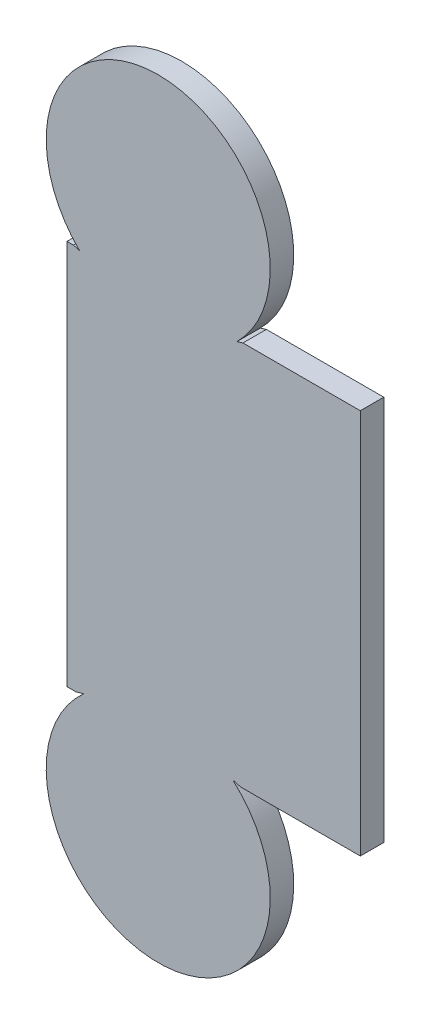
ISO-10303-21;
HEADER;
FILE_DESCRIPTION(('STEP AP214'),'2;1');
FILE_NAME('part.step','',(''),(''),'','','');
FILE_SCHEMA(('AUTOMOTIVE_DESIGN { 1 0 10303 214 1 1 1 1 }'));
ENDSEC;
DATA;
#1=APPLICATION_CONTEXT('core data for automotive mechanical design processes');
#2=APPLICATION_PROTOCOL_DEFINITION('international standard','automotive_design',2000,#1);
#3=PRODUCT_CONTEXT('',#1,'mechanical');
#4=PRODUCT('Part','Part','',(#3));
#5=PRODUCT_RELATED_PRODUCT_CATEGORY('part','',(#4));
#6=PRODUCT_DEFINITION_FORMATION('','',#4);
#7=PRODUCT_DEFINITION_CONTEXT('part definition',#1,'design');
#8=PRODUCT_DEFINITION('design','',#6,#7);
#9=PRODUCT_DEFINITION_SHAPE('','',#8);
#10=(LENGTH_UNIT() NAMED_UNIT(*) SI_UNIT(.MILLI.,.METRE.));
#11=(NAMED_UNIT(*) PLANE_ANGLE_UNIT() SI_UNIT($,.RADIAN.));
#12=(NAMED_UNIT(*) SI_UNIT($,.STERADIAN.) SOLID_ANGLE_UNIT());
#13=UNCERTAINTY_MEASURE_WITH_UNIT(LENGTH_MEASURE(1.E-05),#10,'distance_accuracy_value','');
#14=(GEOMETRIC_REPRESENTATION_CONTEXT(3) GLOBAL_UNCERTAINTY_ASSIGNED_CONTEXT((#13)) GLOBAL_UNIT_ASSIGNED_CONTEXT((#10,
#11,#12)) REPRESENTATION_CONTEXT('',''));
#15=CARTESIAN_POINT('',(0.,0.,0.));
#16=DIRECTION('',(0.,0.,1.));
#17=DIRECTION('',(1.,0.,0.));
#18=AXIS2_PLACEMENT_3D('',#15,#16,#17);
#19=CARTESIAN_POINT('',(231.439551417382,-103.246793579175,283.941063903925));
#20=DIRECTION('',(0.,0.,-1.));
#21=DIRECTION('',(0.,1.,0.));
#22=AXIS2_PLACEMENT_3D('',#19,#20,#21);
#23=CYLINDRICAL_SURFACE('',#22,2.42529676786338);
#24=CARTESIAN_POINT('',(231.439551417382,-103.246793579175,283.432971220494));
#25=DIRECTION('',(0.,0.,-1.));
#26=DIRECTION('',(0.665903119549627,0.746038226483117,0.));
#27=AXIS2_PLACEMENT_3D('',#24,#25,#26);
#28=CIRCLE('',#27,2.42529676786338);
#29=CARTESIAN_POINT('',(233.054564100935,-101.437429479783,283.432971220494));
#30=VERTEX_POINT('',#29);
#31=CARTESIAN_POINT('',(229.824538733828,-101.437429479783,283.432971220494));
#32=VERTEX_POINT('',#31);
#33=EDGE_CURVE('E136',#30,#32,#28,.T.);
#34=ORIENTED_EDGE('',*,*,#33,.F.);
#35=DIRECTION('',(0.,0.,-1.));
#36=VECTOR('',#35,1.);
#37=CARTESIAN_POINT('',(233.054564100935,-101.437429479783,283.941063903925));
#38=LINE('',#37,#36);
#39=CARTESIAN_POINT('',(233.054564100935,-101.437429479783,283.941063903925));
#40=VERTEX_POINT('',#39);
#41=EDGE_CURVE('E32',#40,#30,#38,.T.);
#42=ORIENTED_EDGE('',*,*,#41,.F.);
#43=CARTESIAN_POINT('',(231.439551417382,-103.246793579175,283.941063903925));
#44=DIRECTION('',(0.,0.,-1.));
#45=DIRECTION('',(0.665903119549627,0.746038226483117,0.));
#46=AXIS2_PLACEMENT_3D('',#43,#44,#45);
#47=CIRCLE('',#46,2.42529676786338);
#48=CARTESIAN_POINT('',(229.824538733828,-101.437429479783,283.941063903925));
#49=VERTEX_POINT('',#48);
#50=EDGE_CURVE('E168',#40,#49,#47,.T.);
#51=ORIENTED_EDGE('',*,*,#50,.T.);
#52=DIRECTION('',(0.,0.,-1.));
#53=VECTOR('',#52,1.);
#54=CARTESIAN_POINT('',(229.824538733828,-101.437429479783,283.941063903925));
#55=LINE('',#54,#53);
#56=EDGE_CURVE('E10',#49,#32,#55,.T.);
#57=ORIENTED_EDGE('',*,*,#56,.T.);
#58=EDGE_LOOP('',(#34,#42,#51,#57));
#59=FACE_BOUND('',#58,.T.);
#60=ADVANCED_FACE('F16',(#59),#23,.T.);
#61=CARTESIAN_POINT('',(229.654350957474,-101.483863074311,283.941063903925));
#62=DIRECTION('',(0.2632163146213,-0.964736840655098,0.));
#63=DIRECTION('',(0.964736840655099,0.2632163146213,0.));
#64=AXIS2_PLACEMENT_3D('',#61,#62,#63);
#65=PLANE('',#64);
#66=DIRECTION('',(-0.964736840655099,-0.2632163146213,0.));
#67=VECTOR('',#66,1.);
#68=CARTESIAN_POINT('',(229.654350957474,-101.483863074311,283.432971220494));
#69=LINE('',#68,#67);
#70=CARTESIAN_POINT('',(229.654350957474,-101.483863074311,283.432971220494));
#71=VERTEX_POINT('',#70);
#72=EDGE_CURVE('E139',#32,#71,#69,.T.);
#73=ORIENTED_EDGE('',*,*,#72,.F.);
#74=ORIENTED_EDGE('',*,*,#56,.F.);
#75=DIRECTION('',(-0.964736840655099,-0.2632163146213,0.));
#76=VECTOR('',#75,1.);
#77=CARTESIAN_POINT('',(229.654350957474,-101.483863074311,283.941063903925));
#78=LINE('',#77,#76);
#79=CARTESIAN_POINT('',(229.654350957474,-101.483863074311,283.941063903925));
#80=VERTEX_POINT('',#79);
#81=EDGE_CURVE('E185',#49,#80,#78,.T.);
#82=ORIENTED_EDGE('',*,*,#81,.T.);
#83=DIRECTION('',(0.,0.,-1.));
#84=VECTOR('',#83,1.);
#85=CARTESIAN_POINT('',(229.654350957474,-101.483863074311,283.941063903925));
#86=LINE('',#85,#84);
#87=EDGE_CURVE('E24',#80,#71,#86,.T.);
#88=ORIENTED_EDGE('',*,*,#87,.T.);
#89=EDGE_LOOP('',(#73,#74,#82,#88));
#90=FACE_BOUND('',#89,.T.);
#91=ADVANCED_FACE('F184',(#90),#65,.T.);
#92=CARTESIAN_POINT('',(229.654350957474,-101.483863074311,283.941063903925));
#93=DIRECTION('',(0.,-1.,0.));
#94=DIRECTION('',(0.,0.,-1.));
#95=AXIS2_PLACEMENT_3D('',#92,#93,#94);
#96=PLANE('',#95);
#97=DIRECTION('',(-1.,0.,0.));
#98=VECTOR('',#97,1.);
#99=CARTESIAN_POINT('',(229.654350957474,-101.483863074311,283.432971220494));
#100=LINE('',#99,#98);
#101=CARTESIAN_POINT('',(229.464481922245,-101.483863074311,283.432971220494));
#102=VERTEX_POINT('',#101);
#103=EDGE_CURVE('E142',#71,#102,#100,.T.);
#104=ORIENTED_EDGE('',*,*,#103,.F.);
#105=ORIENTED_EDGE('',*,*,#87,.F.);
#106=DIRECTION('',(-1.,0.,0.));
#107=VECTOR('',#106,1.);
#108=CARTESIAN_POINT('',(229.654350957474,-101.483863074311,283.941063903925));
#109=LINE('',#108,#107);
#110=CARTESIAN_POINT('',(229.464481922245,-101.483863074311,283.941063903925));
#111=VERTEX_POINT('',#110);
#112=EDGE_CURVE('E194',#80,#111,#109,.T.);
#113=ORIENTED_EDGE('',*,*,#112,.T.);
#114=DIRECTION('',(0.,0.,-1.));
#115=VECTOR('',#114,1.);
#116=CARTESIAN_POINT('',(229.464481922245,-101.483863074311,283.941063903925));
#117=LINE('',#116,#115);
#118=EDGE_CURVE('E182',#111,#102,#117,.T.);
#119=ORIENTED_EDGE('',*,*,#118,.T.);
#120=EDGE_LOOP('',(#104,#105,#113,#119));
#121=FACE_BOUND('',#120,.T.);
#122=ADVANCED_FACE('F189',(#121),#96,.T.);
#123=CARTESIAN_POINT('',(229.464481922245,-101.483863074311,283.941063903925));
#124=DIRECTION('',(-1.,0.,0.));
#125=DIRECTION('',(0.,0.,1.));
#126=AXIS2_PLACEMENT_3D('',#123,#124,#125);
#127=PLANE('',#126);
#128=DIRECTION('',(0.,1.,0.));
#129=VECTOR('',#128,1.);
#130=CARTESIAN_POINT('',(229.464481922245,-101.483863074311,283.432971220494));
#131=LINE('',#130,#129);
#132=CARTESIAN_POINT('',(229.464481922245,-93.1337240840387,283.432971220494));
#133=VERTEX_POINT('',#132);
#134=EDGE_CURVE('E145',#102,#133,#131,.T.);
#135=ORIENTED_EDGE('',*,*,#134,.F.);
#136=ORIENTED_EDGE('',*,*,#118,.F.);
#137=DIRECTION('',(0.,1.,0.));
#138=VECTOR('',#137,1.);
#139=CARTESIAN_POINT('',(229.464481922245,-101.483863074311,283.941063903925));
#140=LINE('',#139,#138);
#141=CARTESIAN_POINT('',(229.464481922245,-93.1337240840387,283.941063903925));
#142=VERTEX_POINT('',#141);
#143=EDGE_CURVE('E198',#111,#142,#140,.T.);
#144=ORIENTED_EDGE('',*,*,#143,.T.);
#145=DIRECTION('',(0.,0.,-1.));
#146=VECTOR('',#145,1.);
#147=CARTESIAN_POINT('',(229.464481922245,-93.1337240840387,283.941063903925));
#148=LINE('',#147,#146);
#149=EDGE_CURVE('E180',#142,#133,#148,.T.);
#150=ORIENTED_EDGE('',*,*,#149,.T.);
#151=EDGE_LOOP('',(#135,#136,#144,#150));
#152=FACE_BOUND('',#151,.T.);
#153=ADVANCED_FACE('F233',(#152),#127,.T.);
#154=CARTESIAN_POINT('',(229.464481922245,-93.1337240840387,283.941063903925));
#155=DIRECTION('',(0.,1.,0.));
#156=DIRECTION('',(0.,0.,1.));
#157=AXIS2_PLACEMENT_3D('',#154,#155,#156);
#158=PLANE('',#157);
#159=DIRECTION('',(1.,0.,0.));
#160=VECTOR('',#159,1.);
#161=CARTESIAN_POINT('',(229.464481922245,-93.1337240840387,283.432971220494));
#162=LINE('',#161,#160);
#163=CARTESIAN_POINT('',(229.605920498005,-93.1337240840387,283.432971220494));
#164=VERTEX_POINT('',#163);
#165=EDGE_CURVE('E148',#133,#164,#162,.T.);
#166=ORIENTED_EDGE('',*,*,#165,.F.);
#167=ORIENTED_EDGE('',*,*,#149,.F.);
#168=DIRECTION('',(1.,0.,0.));
#169=VECTOR('',#168,1.);
#170=CARTESIAN_POINT('',(229.464481922245,-93.1337240840387,283.941063903925));
#171=LINE('',#170,#169);
#172=CARTESIAN_POINT('',(229.605920498005,-93.1337240840387,283.941063903925));
#173=VERTEX_POINT('',#172);
#174=EDGE_CURVE('E201',#142,#173,#171,.T.);
#175=ORIENTED_EDGE('',*,*,#174,.T.);
#176=DIRECTION('',(0.,0.,-1.));
#177=VECTOR('',#176,1.);
#178=CARTESIAN_POINT('',(229.605920498005,-93.1337240840387,283.941063903925));
#179=LINE('',#178,#177);
#180=EDGE_CURVE('E178',#173,#164,#179,.T.);
#181=ORIENTED_EDGE('',*,*,#180,.T.);
#182=EDGE_LOOP('',(#166,#167,#175,#181));
#183=FACE_BOUND('',#182,.T.);
#184=ADVANCED_FACE('F231',(#183),#158,.T.);
#185=CARTESIAN_POINT('',(230.176772899703,-93.3090208519021,283.941063903925));
#186=DIRECTION('',(0.29355019531881,0.955943660907006,0.));
#187=DIRECTION('',(-0.955943660907006,0.29355019531881,0.));
#188=AXIS2_PLACEMENT_3D('',#185,#186,#187);
#189=PLANE('',#188);
#190=DIRECTION('',(0.955943660907006,-0.29355019531881,0.));
#191=VECTOR('',#190,1.);
#192=CARTESIAN_POINT('',(230.176772899703,-93.3090208519021,283.432971220494));
#193=LINE('',#192,#191);
#194=CARTESIAN_POINT('',(229.736904236446,-93.1739464356012,283.432971220494));
#195=VERTEX_POINT('',#194);
#196=EDGE_CURVE('E151',#164,#195,#193,.T.);
#197=ORIENTED_EDGE('',*,*,#196,.F.);
#198=ORIENTED_EDGE('',*,*,#180,.F.);
#199=DIRECTION('',(0.955943660907006,-0.29355019531881,0.));
#200=VECTOR('',#199,1.);
#201=CARTESIAN_POINT('',(230.176772899703,-93.3090208519021,283.941063903925));
#202=LINE('',#201,#200);
#203=CARTESIAN_POINT('',(229.736904236446,-93.1739464356012,283.941063903925));
#204=VERTEX_POINT('',#203);
#205=EDGE_CURVE('E204',#173,#204,#202,.T.);
#206=ORIENTED_EDGE('',*,*,#205,.T.);
#207=DIRECTION('',(0.,0.,-1.));
#208=VECTOR('',#207,1.);
#209=CARTESIAN_POINT('',(229.736904236446,-93.1739464356012,283.941063903925));
#210=LINE('',#209,#208);
#211=EDGE_CURVE('E176',#204,#195,#210,.T.);
#212=ORIENTED_EDGE('',*,*,#211,.T.);
#213=EDGE_LOOP('',(#197,#198,#206,#212));
#214=FACE_BOUND('',#213,.T.);
#215=ADVANCED_FACE('F226',(#214),#189,.T.);
#216=CARTESIAN_POINT('',(231.439551417381,-91.4467935791749,283.941063903925));
#217=DIRECTION('',(0.,0.,-1.));
#218=DIRECTION('',(0.,1.,0.));
#219=AXIS2_PLACEMENT_3D('',#216,#217,#218);
#220=CYLINDRICAL_SURFACE('',#219,2.42529676786337);
#221=CARTESIAN_POINT('',(231.439551417381,-91.4467935791749,283.432971220494));
#222=DIRECTION('',(0.,0.,-1.));
#223=DIRECTION('',(-0.702036634648751,-0.712140831304495,0.));
#224=AXIS2_PLACEMENT_3D('',#221,#222,#223);
#225=CIRCLE('',#224,2.42529676786337);
#226=CARTESIAN_POINT('',(233.142198598317,-93.1739464356012,283.432971220494));
#227=VERTEX_POINT('',#226);
#228=EDGE_CURVE('E154',#195,#227,#225,.T.);
#229=ORIENTED_EDGE('',*,*,#228,.F.);
#230=ORIENTED_EDGE('',*,*,#211,.F.);
#231=CARTESIAN_POINT('',(231.439551417381,-91.4467935791749,283.941063903925));
#232=DIRECTION('',(0.,0.,-1.));
#233=DIRECTION('',(-0.702036634648751,-0.712140831304495,0.));
#234=AXIS2_PLACEMENT_3D('',#231,#232,#233);
#235=CIRCLE('',#234,2.42529676786337);
#236=CARTESIAN_POINT('',(233.142198598317,-93.1739464356012,283.941063903925));
#237=VERTEX_POINT('',#236);
#238=EDGE_CURVE('E207',#204,#237,#235,.T.);
#239=ORIENTED_EDGE('',*,*,#238,.T.);
#240=DIRECTION('',(0.,0.,-1.));
#241=VECTOR('',#240,1.);
#242=CARTESIAN_POINT('',(233.142198598317,-93.1739464356012,283.941063903925));
#243=LINE('',#242,#241);
#244=EDGE_CURVE('E174',#237,#227,#243,.T.);
#245=ORIENTED_EDGE('',*,*,#244,.T.);
#246=EDGE_LOOP('',(#229,#230,#239,#245));
#247=FACE_BOUND('',#246,.T.);
#248=ADVANCED_FACE('F223',(#247),#220,.T.);
#249=CARTESIAN_POINT('',(233.273182336758,-93.1337240840387,283.941063903925));
#250=DIRECTION('',(-0.293550195318836,0.955943660906998,0.));
#251=DIRECTION('',(-0.955943660906998,-0.293550195318836,0.));
#252=AXIS2_PLACEMENT_3D('',#249,#250,#251);
#253=PLANE('',#252);
#254=DIRECTION('',(0.955943660906998,0.293550195318836,0.));
#255=VECTOR('',#254,1.);
#256=CARTESIAN_POINT('',(233.273182336758,-93.1337240840387,283.432971220494));
#257=LINE('',#256,#255);
#258=CARTESIAN_POINT('',(233.273182336758,-93.1337240840387,283.432971220494));
#259=VERTEX_POINT('',#258);
#260=EDGE_CURVE('E157',#227,#259,#257,.T.);
#261=ORIENTED_EDGE('',*,*,#260,.F.);
#262=ORIENTED_EDGE('',*,*,#244,.F.);
#263=DIRECTION('',(0.955943660906998,0.293550195318836,0.));
#264=VECTOR('',#263,1.);
#265=CARTESIAN_POINT('',(233.273182336758,-93.1337240840387,283.941063903925));
#266=LINE('',#265,#264);
#267=CARTESIAN_POINT('',(233.273182336758,-93.1337240840387,283.941063903925));
#268=VERTEX_POINT('',#267);
#269=EDGE_CURVE('E210',#237,#268,#266,.T.);
#270=ORIENTED_EDGE('',*,*,#269,.T.);
#271=DIRECTION('',(0.,0.,-1.));
#272=VECTOR('',#271,1.);
#273=CARTESIAN_POINT('',(233.273182336758,-93.1337240840387,283.941063903925));
#274=LINE('',#273,#272);
#275=EDGE_CURVE('E172',#268,#259,#274,.T.);
#276=ORIENTED_EDGE('',*,*,#275,.T.);
#277=EDGE_LOOP('',(#261,#262,#270,#276));
#278=FACE_BOUND('',#277,.T.);
#279=ADVANCED_FACE('F220',(#278),#253,.T.);
#280=CARTESIAN_POINT('',(233.273182336758,-93.1337240840387,283.941063903925));
#281=DIRECTION('',(0.,1.,0.));
#282=DIRECTION('',(0.,0.,1.));
#283=AXIS2_PLACEMENT_3D('',#280,#281,#282);
#284=PLANE('',#283);
#285=DIRECTION('',(1.,0.,0.));
#286=VECTOR('',#285,1.);
#287=CARTESIAN_POINT('',(233.273182336758,-93.1337240840387,283.432971220494));
#288=LINE('',#287,#286);
#289=CARTESIAN_POINT('',(235.814620912518,-93.1337240840388,283.432971220494));
#290=VERTEX_POINT('',#289);
#291=EDGE_CURVE('E160',#259,#290,#288,.T.);
#292=ORIENTED_EDGE('',*,*,#291,.F.);
#293=ORIENTED_EDGE('',*,*,#275,.F.);
#294=DIRECTION('',(1.,0.,0.));
#295=VECTOR('',#294,1.);
#296=CARTESIAN_POINT('',(233.273182336758,-93.1337240840387,283.941063903925));
#297=LINE('',#296,#295);
#298=CARTESIAN_POINT('',(235.814620912518,-93.1337240840388,283.941063903925));
#299=VERTEX_POINT('',#298);
#300=EDGE_CURVE('E127',#268,#299,#297,.T.);
#301=ORIENTED_EDGE('',*,*,#300,.T.);
#302=DIRECTION('',(0.,0.,-1.));
#303=VECTOR('',#302,1.);
#304=CARTESIAN_POINT('',(235.814620912518,-93.1337240840388,283.941063903925));
#305=LINE('',#304,#303);
#306=EDGE_CURVE('E119',#299,#290,#305,.T.);
#307=ORIENTED_EDGE('',*,*,#306,.T.);
#308=EDGE_LOOP('',(#292,#293,#301,#307));
#309=FACE_BOUND('',#308,.T.);
#310=ADVANCED_FACE('F214',(#309),#284,.T.);
#311=CARTESIAN_POINT('',(235.814620912518,-93.1337240840388,283.941063903925));
#312=DIRECTION('',(1.,0.,0.));
#313=DIRECTION('',(0.,0.,-1.));
#314=AXIS2_PLACEMENT_3D('',#311,#312,#313);
#315=PLANE('',#314);
#316=DIRECTION('',(0.,-1.,0.));
#317=VECTOR('',#316,1.);
#318=CARTESIAN_POINT('',(235.814620912518,-93.1337240840388,283.432971220494));
#319=LINE('',#318,#317);
#320=CARTESIAN_POINT('',(235.814620912518,-101.483863074311,283.432971220494));
#321=VERTEX_POINT('',#320);
#322=EDGE_CURVE('E163',#290,#321,#319,.T.);
#323=ORIENTED_EDGE('',*,*,#322,.F.);
#324=ORIENTED_EDGE('',*,*,#306,.F.);
#325=DIRECTION('',(0.,-1.,0.));
#326=VECTOR('',#325,1.);
#327=CARTESIAN_POINT('',(235.814620912518,-93.1337240840388,283.941063903925));
#328=LINE('',#327,#326);
#329=CARTESIAN_POINT('',(235.814620912518,-101.483863074311,283.941063903925));
#330=VERTEX_POINT('',#329);
#331=EDGE_CURVE('E122',#299,#330,#328,.T.);
#332=ORIENTED_EDGE('',*,*,#331,.T.);
#333=DIRECTION('',(0.,0.,-1.));
#334=VECTOR('',#333,1.);
#335=CARTESIAN_POINT('',(235.814620912518,-101.483863074311,283.941063903925));
#336=LINE('',#335,#334);
#337=EDGE_CURVE('E108',#330,#321,#336,.T.);
#338=ORIENTED_EDGE('',*,*,#337,.T.);
#339=EDGE_LOOP('',(#323,#324,#332,#338));
#340=FACE_BOUND('',#339,.T.);
#341=ADVANCED_FACE('F123',(#340),#315,.T.);
#342=CARTESIAN_POINT('',(235.814620912518,-101.483863074311,283.941063903925));
#343=DIRECTION('',(0.,-1.,0.));
#344=DIRECTION('',(0.,0.,-1.));
#345=AXIS2_PLACEMENT_3D('',#342,#343,#344);
#346=PLANE('',#345);
#347=DIRECTION('',(-1.,0.,0.));
#348=VECTOR('',#347,1.);
#349=CARTESIAN_POINT('',(235.814620912518,-101.483863074311,283.432971220494));
#350=LINE('',#349,#348);
#351=CARTESIAN_POINT('',(233.224751877289,-101.483863074311,283.432971220494));
#352=VERTEX_POINT('',#351);
#353=EDGE_CURVE('E115',#321,#352,#350,.T.);
#354=ORIENTED_EDGE('',*,*,#353,.F.);
#355=ORIENTED_EDGE('',*,*,#337,.F.);
#356=DIRECTION('',(-1.,0.,0.));
#357=VECTOR('',#356,1.);
#358=CARTESIAN_POINT('',(235.814620912518,-101.483863074311,283.941063903925));
#359=LINE('',#358,#357);
#360=CARTESIAN_POINT('',(233.224751877289,-101.483863074311,283.941063903925));
#361=VERTEX_POINT('',#360);
#362=EDGE_CURVE('E112',#330,#361,#359,.T.);
#363=ORIENTED_EDGE('',*,*,#362,.T.);
#364=DIRECTION('',(0.,0.,-1.));
#365=VECTOR('',#364,1.);
#366=CARTESIAN_POINT('',(233.224751877289,-101.483863074311,283.941063903925));
#367=LINE('',#366,#365);
#368=EDGE_CURVE('E72',#361,#352,#367,.T.);
#369=ORIENTED_EDGE('',*,*,#368,.T.);
#370=EDGE_LOOP('',(#354,#355,#363,#369));
#371=FACE_BOUND('',#370,.T.);
#372=ADVANCED_FACE('F110',(#371),#346,.T.);
#373=CARTESIAN_POINT('',(232.582256558376,-101.308566306448,283.941063903925));
#374=DIRECTION('',(-0.263216314621321,-0.964736840655093,0.));
#375=DIRECTION('',(0.964736840655093,-0.263216314621321,0.));
#376=AXIS2_PLACEMENT_3D('',#373,#374,#375);
#377=PLANE('',#376);
#378=DIRECTION('',(-0.964736840655093,0.263216314621321,0.));
#379=VECTOR('',#378,1.);
#380=CARTESIAN_POINT('',(232.582256558376,-101.308566306448,283.432971220494));
#381=LINE('',#380,#379);
#382=EDGE_CURVE('E166',#352,#30,#381,.T.);
#383=ORIENTED_EDGE('',*,*,#382,.F.);
#384=ORIENTED_EDGE('',*,*,#368,.F.);
#385=DIRECTION('',(-0.964736840655093,0.263216314621321,0.));
#386=VECTOR('',#385,1.);
#387=CARTESIAN_POINT('',(232.582256558376,-101.308566306448,283.941063903925));
#388=LINE('',#387,#386);
#389=EDGE_CURVE('E131',#361,#40,#388,.T.);
#390=ORIENTED_EDGE('',*,*,#389,.T.);
#391=ORIENTED_EDGE('',*,*,#41,.T.);
#392=EDGE_LOOP('',(#383,#384,#390,#391));
#393=FACE_BOUND('',#392,.T.);
#394=ADVANCED_FACE('F325',(#393),#377,.T.);
#395=CARTESIAN_POINT('',(206.339551417381,-113.096793579175,283.941063903925));
#396=DIRECTION('',(0.,0.,-1.));
#397=DIRECTION('',(0.,1.,0.));
#398=AXIS2_PLACEMENT_3D('',#395,#396,#397);
#399=PLANE('',#398);
#400=ORIENTED_EDGE('',*,*,#50,.F.);
#401=ORIENTED_EDGE('',*,*,#389,.F.);
#402=ORIENTED_EDGE('',*,*,#362,.F.);
#403=ORIENTED_EDGE('',*,*,#331,.F.);
#404=ORIENTED_EDGE('',*,*,#300,.F.);
#405=ORIENTED_EDGE('',*,*,#269,.F.);
#406=ORIENTED_EDGE('',*,*,#238,.F.);
#407=ORIENTED_EDGE('',*,*,#205,.F.);
#408=ORIENTED_EDGE('',*,*,#174,.F.);
#409=ORIENTED_EDGE('',*,*,#143,.F.);
#410=ORIENTED_EDGE('',*,*,#112,.F.);
#411=ORIENTED_EDGE('',*,*,#81,.F.);
#412=EDGE_LOOP('',(#400,#401,#402,#403,#404,#405,#406,#407,#408,#409,#410,#411));
#413=FACE_BOUND('',#412,.T.);
#414=ADVANCED_FACE('F130',(#413),#399,.F.);
#415=CARTESIAN_POINT('',(206.339551417381,-113.096793579175,283.432971220494));
#416=DIRECTION('',(0.,0.,-1.));
#417=DIRECTION('',(0.,1.,0.));
#418=AXIS2_PLACEMENT_3D('',#415,#416,#417);
#419=PLANE('',#418);
#420=ORIENTED_EDGE('',*,*,#33,.T.);
#421=ORIENTED_EDGE('',*,*,#72,.T.);
#422=ORIENTED_EDGE('',*,*,#103,.T.);
#423=ORIENTED_EDGE('',*,*,#134,.T.);
#424=ORIENTED_EDGE('',*,*,#165,.T.);
#425=ORIENTED_EDGE('',*,*,#196,.T.);
#426=ORIENTED_EDGE('',*,*,#228,.T.);
#427=ORIENTED_EDGE('',*,*,#260,.T.);
#428=ORIENTED_EDGE('',*,*,#291,.T.);
#429=ORIENTED_EDGE('',*,*,#322,.T.);
#430=ORIENTED_EDGE('',*,*,#353,.T.);
#431=ORIENTED_EDGE('',*,*,#382,.T.);
#432=EDGE_LOOP('',(#420,#421,#422,#423,#424,#425,#426,#427,#428,#429,#430,#431));
#433=FACE_BOUND('',#432,.T.);
#434=ADVANCED_FACE('F192',(#433),#419,.T.);
#435=CLOSED_SHELL('',(#60,#91,#122,#153,#184,#215,#248,#279,#310,#341,#372,#394,#414,#434));
#436=MANIFOLD_SOLID_BREP('B1',#435);
#437=ADVANCED_BREP_SHAPE_REPRESENTATION('',(#18,#436),#14);
#438=SHAPE_DEFINITION_REPRESENTATION(#9,#437);
ENDSEC;
END-ISO-10303-21;
